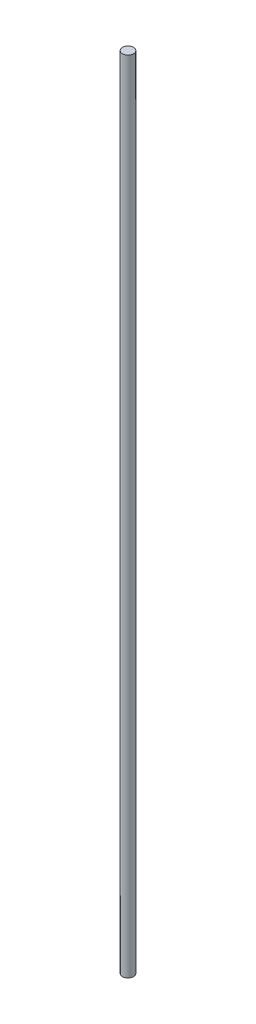
ISO-10303-21;
HEADER;
FILE_DESCRIPTION(('STEP AP214'),'2;1');
FILE_NAME('part.step','',(''),(''),'','','');
FILE_SCHEMA(('AUTOMOTIVE_DESIGN { 1 0 10303 214 1 1 1 1 }'));
ENDSEC;
DATA;
#1=APPLICATION_CONTEXT('core data for automotive mechanical design processes');
#2=APPLICATION_PROTOCOL_DEFINITION('international standard','automotive_design',2000,#1);
#3=PRODUCT_CONTEXT('',#1,'mechanical');
#4=PRODUCT('Part','Part','',(#3));
#5=PRODUCT_RELATED_PRODUCT_CATEGORY('part','',(#4));
#6=PRODUCT_DEFINITION_FORMATION('','',#4);
#7=PRODUCT_DEFINITION_CONTEXT('part definition',#1,'design');
#8=PRODUCT_DEFINITION('design','',#6,#7);
#9=PRODUCT_DEFINITION_SHAPE('','',#8);
#10=(LENGTH_UNIT() NAMED_UNIT(*) SI_UNIT(.MILLI.,.METRE.));
#11=(NAMED_UNIT(*) PLANE_ANGLE_UNIT() SI_UNIT($,.RADIAN.));
#12=(NAMED_UNIT(*) SI_UNIT($,.STERADIAN.) SOLID_ANGLE_UNIT());
#13=UNCERTAINTY_MEASURE_WITH_UNIT(LENGTH_MEASURE(1.E-05),#10,'distance_accuracy_value','');
#14=(GEOMETRIC_REPRESENTATION_CONTEXT(3) GLOBAL_UNCERTAINTY_ASSIGNED_CONTEXT((#13)) GLOBAL_UNIT_ASSIGNED_CONTEXT((#10,
#11,#12)) REPRESENTATION_CONTEXT('',''));
#15=CARTESIAN_POINT('',(0.,0.,0.));
#16=DIRECTION('',(0.,0.,1.));
#17=DIRECTION('',(1.,0.,0.));
#18=AXIS2_PLACEMENT_3D('',#15,#16,#17);
#19=CARTESIAN_POINT('',(0.,360.,0.));
#20=DIRECTION('',(0.,-1.,0.));
#21=DIRECTION('',(0.,0.,-1.));
#22=AXIS2_PLACEMENT_3D('',#19,#20,#21);
#23=CYLINDRICAL_SURFACE('',#22,2.5);
#24=CARTESIAN_POINT('',(0.,360.,0.));
#25=DIRECTION('',(0.,1.,0.));
#26=DIRECTION('',(0.,0.,1.));
#27=AXIS2_PLACEMENT_3D('',#24,#25,#26);
#28=CIRCLE('',#27,2.5);
#29=CARTESIAN_POINT('',(0.,360.,2.5));
#30=VERTEX_POINT('',#29);
#31=EDGE_CURVE('E10',#30,#30,#28,.T.);
#32=ORIENTED_EDGE('',*,*,#31,.F.);
#33=EDGE_LOOP('',(#32));
#34=FACE_BOUND('',#33,.T.);
#35=CARTESIAN_POINT('',(0.,0.,0.));
#36=DIRECTION('',(0.,1.,0.));
#37=DIRECTION('',(0.,0.,1.));
#38=AXIS2_PLACEMENT_3D('',#35,#36,#37);
#39=CIRCLE('',#38,2.5);
#40=CARTESIAN_POINT('',(0.,0.,2.5));
#41=VERTEX_POINT('',#40);
#42=EDGE_CURVE('E40',#41,#41,#39,.T.);
#43=ORIENTED_EDGE('',*,*,#42,.T.);
#44=EDGE_LOOP('',(#43));
#45=FACE_BOUND('',#44,.T.);
#46=ADVANCED_FACE('F37',(#34,#45),#23,.T.);
#47=CARTESIAN_POINT('',(0.,360.,0.));
#48=DIRECTION('',(0.,1.,0.));
#49=DIRECTION('',(0.,0.,1.));
#50=AXIS2_PLACEMENT_3D('',#47,#48,#49);
#51=PLANE('',#50);
#52=ORIENTED_EDGE('',*,*,#31,.T.);
#53=EDGE_LOOP('',(#52));
#54=FACE_BOUND('',#53,.T.);
#55=ADVANCED_FACE('F54',(#54),#51,.T.);
#56=CARTESIAN_POINT('',(0.,0.,0.));
#57=DIRECTION('',(0.,1.,0.));
#58=DIRECTION('',(0.,0.,1.));
#59=AXIS2_PLACEMENT_3D('',#56,#57,#58);
#60=PLANE('',#59);
#61=ORIENTED_EDGE('',*,*,#42,.F.);
#62=EDGE_LOOP('',(#61));
#63=FACE_BOUND('',#62,.T.);
#64=ADVANCED_FACE('F52',(#63),#60,.F.);
#65=CLOSED_SHELL('',(#46,#55,#64));
#66=MANIFOLD_SOLID_BREP('B2',#65);
#67=ADVANCED_BREP_SHAPE_REPRESENTATION('',(#18,#66),#14);
#68=SHAPE_DEFINITION_REPRESENTATION(#9,#67);
ENDSEC;
END-ISO-10303-21;
